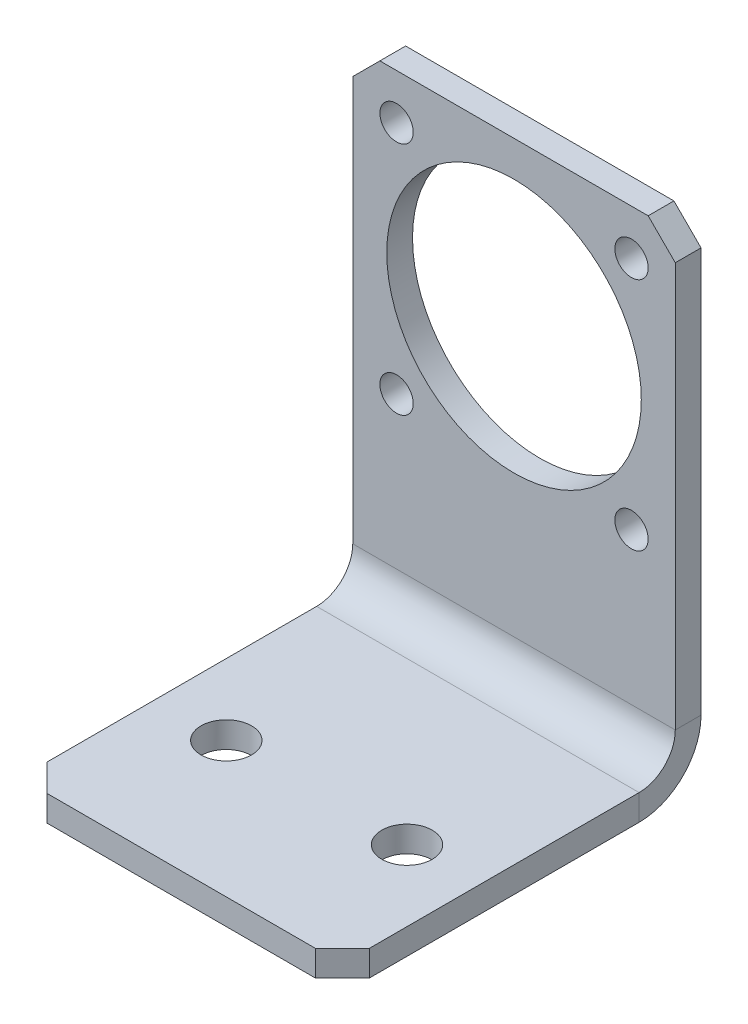
ISO-10303-21;
HEADER;
FILE_DESCRIPTION(('STEP AP214'),'2;1');
FILE_NAME('part.step','',(''),(''),'','','');
FILE_SCHEMA(('AUTOMOTIVE_DESIGN { 1 0 10303 214 1 1 1 1 }'));
ENDSEC;
DATA;
#1=APPLICATION_CONTEXT('core data for automotive mechanical design processes');
#2=APPLICATION_PROTOCOL_DEFINITION('international standard','automotive_design',2000,#1);
#3=PRODUCT_CONTEXT('',#1,'mechanical');
#4=PRODUCT('Part','Part','',(#3));
#5=PRODUCT_RELATED_PRODUCT_CATEGORY('part','',(#4));
#6=PRODUCT_DEFINITION_FORMATION('','',#4);
#7=PRODUCT_DEFINITION_CONTEXT('part definition',#1,'design');
#8=PRODUCT_DEFINITION('design','',#6,#7);
#9=PRODUCT_DEFINITION_SHAPE('','',#8);
#10=(LENGTH_UNIT() NAMED_UNIT(*) SI_UNIT(.MILLI.,.METRE.));
#11=(NAMED_UNIT(*) PLANE_ANGLE_UNIT() SI_UNIT($,.RADIAN.));
#12=(NAMED_UNIT(*) SI_UNIT($,.STERADIAN.) SOLID_ANGLE_UNIT());
#13=UNCERTAINTY_MEASURE_WITH_UNIT(LENGTH_MEASURE(1.E-05),#10,'distance_accuracy_value','');
#14=(GEOMETRIC_REPRESENTATION_CONTEXT(3) GLOBAL_UNCERTAINTY_ASSIGNED_CONTEXT((#13)) GLOBAL_UNIT_ASSIGNED_CONTEXT((#10,
#11,#12)) REPRESENTATION_CONTEXT('',''));
#15=CARTESIAN_POINT('',(0.,0.,0.));
#16=DIRECTION('',(0.,0.,1.));
#17=DIRECTION('',(1.,0.,0.));
#18=AXIS2_PLACEMENT_3D('',#15,#16,#17);
#19=CARTESIAN_POINT('',(0.,7.20842992713764,7.72999999999997));
#20=DIRECTION('',(0.,0.,-1.));
#21=DIRECTION('',(0.,1.,0.));
#22=AXIS2_PLACEMENT_3D('',#19,#20,#21);
#23=PLANE('',#22);
#24=CARTESIAN_POINT('',(13.,20.7784299271377,7.72999999999995));
#25=DIRECTION('',(0.,0.,1.));
#26=DIRECTION('',(-1.,0.,0.));
#27=AXIS2_PLACEMENT_3D('',#24,#25,#26);
#28=CIRCLE('',#27,1.845);
#29=CARTESIAN_POINT('',(11.155,20.7784299271377,7.72999999999995));
#30=VERTEX_POINT('',#29);
#31=EDGE_CURVE('E234',#30,#30,#28,.T.);
#32=ORIENTED_EDGE('',*,*,#31,.F.);
#33=EDGE_LOOP('',(#32));
#34=FACE_BOUND('',#33,.T.);
#35=CARTESIAN_POINT('',(-13.,20.7784299271377,7.72999999999995));
#36=DIRECTION('',(0.,0.,1.));
#37=DIRECTION('',(1.,0.,0.));
#38=AXIS2_PLACEMENT_3D('',#35,#36,#37);
#39=CIRCLE('',#38,1.845);
#40=CARTESIAN_POINT('',(-11.155,20.7784299271377,7.72999999999995));
#41=VERTEX_POINT('',#40);
#42=EDGE_CURVE('E230',#41,#41,#39,.T.);
#43=ORIENTED_EDGE('',*,*,#42,.F.);
#44=EDGE_LOOP('',(#43));
#45=FACE_BOUND('',#44,.T.);
#46=CARTESIAN_POINT('',(-13.,46.7784299271377,7.72999999999995));
#47=DIRECTION('',(0.,0.,1.));
#48=DIRECTION('',(-1.,0.,0.));
#49=AXIS2_PLACEMENT_3D('',#46,#47,#48);
#50=CIRCLE('',#49,1.845);
#51=CARTESIAN_POINT('',(-14.845,46.7784299271377,7.72999999999995));
#52=VERTEX_POINT('',#51);
#53=EDGE_CURVE('E226',#52,#52,#50,.T.);
#54=ORIENTED_EDGE('',*,*,#53,.F.);
#55=EDGE_LOOP('',(#54));
#56=FACE_BOUND('',#55,.T.);
#57=CARTESIAN_POINT('',(13.,46.7784299271377,7.72999999999995));
#58=DIRECTION('',(0.,0.,1.));
#59=DIRECTION('',(1.,0.,0.));
#60=AXIS2_PLACEMENT_3D('',#57,#58,#59);
#61=CIRCLE('',#60,1.845);
#62=CARTESIAN_POINT('',(14.845,46.7784299271377,7.72999999999995));
#63=VERTEX_POINT('',#62);
#64=EDGE_CURVE('E222',#63,#63,#61,.T.);
#65=ORIENTED_EDGE('',*,*,#64,.F.);
#66=EDGE_LOOP('',(#65));
#67=FACE_BOUND('',#66,.T.);
#68=CARTESIAN_POINT('',(0.,33.7784299271377,7.72999999999995));
#69=DIRECTION('',(0.,0.,1.));
#70=DIRECTION('',(1.,0.,0.));
#71=AXIS2_PLACEMENT_3D('',#68,#69,#70);
#72=CIRCLE('',#71,14.0825);
#73=CARTESIAN_POINT('',(14.0825,33.7784299271377,7.72999999999995));
#74=VERTEX_POINT('',#73);
#75=EDGE_CURVE('E218',#74,#74,#72,.T.);
#76=ORIENTED_EDGE('',*,*,#75,.F.);
#77=EDGE_LOOP('',(#76));
#78=FACE_BOUND('',#77,.T.);
#79=DIRECTION('',(0.,1.,0.));
#80=VECTOR('',#79,1.);
#81=CARTESIAN_POINT('',(17.845,-37.3615700728623,7.72999999999982));
#82=LINE('',#81,#80);
#83=CARTESIAN_POINT('',(17.845,4.00000000000001,7.72999999999996));
#84=VERTEX_POINT('',#83);
#85=CARTESIAN_POINT('',(17.845,48.7784299271376,7.73000000000012));
#86=VERTEX_POINT('',#85);
#87=EDGE_CURVE('E165',#84,#86,#82,.T.);
#88=ORIENTED_EDGE('',*,*,#87,.T.);
#89=DIRECTION('',(0.707106781186551,-0.707106781186544,0.));
#90=VECTOR('',#89,1.);
#91=CARTESIAN_POINT('',(17.845,48.7784299271376,7.73000000000012));
#92=LINE('',#91,#90);
#93=CARTESIAN_POINT('',(14.845,51.7784299271376,7.73000000000013));
#94=VERTEX_POINT('',#93);
#95=EDGE_CURVE('E255',#86,#94,#92,.F.);
#96=ORIENTED_EDGE('',*,*,#95,.T.);
#97=DIRECTION('',(-1.,0.,0.));
#98=VECTOR('',#97,1.);
#99=CARTESIAN_POINT('',(-17.845,51.7784299271376,7.73000000000013));
#100=LINE('',#99,#98);
#101=CARTESIAN_POINT('',(-14.845,51.7784299271376,7.73000000000013));
#102=VERTEX_POINT('',#101);
#103=EDGE_CURVE('E194',#94,#102,#100,.T.);
#104=ORIENTED_EDGE('',*,*,#103,.T.);
#105=DIRECTION('',(0.707106781186545,0.70710678118655,0.));
#106=VECTOR('',#105,1.);
#107=CARTESIAN_POINT('',(-14.845,51.7784299271376,7.73000000000013));
#108=LINE('',#107,#106);
#109=CARTESIAN_POINT('',(-17.845,48.7784299271376,7.73000000000012));
#110=VERTEX_POINT('',#109);
#111=EDGE_CURVE('E253',#102,#110,#108,.F.);
#112=ORIENTED_EDGE('',*,*,#111,.T.);
#113=DIRECTION('',(0.,-1.,0.));
#114=VECTOR('',#113,1.);
#115=CARTESIAN_POINT('',(-17.845,-37.3615700728623,7.72999999999982));
#116=LINE('',#115,#114);
#117=CARTESIAN_POINT('',(-17.845,4.00000000000001,7.72999999999996));
#118=VERTEX_POINT('',#117);
#119=EDGE_CURVE('E197',#110,#118,#116,.T.);
#120=ORIENTED_EDGE('',*,*,#119,.T.);
#121=DIRECTION('',(1.,0.,0.));
#122=VECTOR('',#121,1.);
#123=CARTESIAN_POINT('',(0.,4.00000000000001,7.72999999999996));
#124=LINE('',#123,#122);
#125=EDGE_CURVE('E203',#118,#84,#124,.T.);
#126=ORIENTED_EDGE('',*,*,#125,.T.);
#127=EDGE_LOOP('',(#88,#96,#104,#112,#120,#126));
#128=FACE_BOUND('',#127,.T.);
#129=ADVANCED_FACE('F42',(#34,#45,#56,#67,#78,#128),#23,.F.);
#130=CARTESIAN_POINT('',(17.845,-37.3615700728623,4.87999999999982));
#131=DIRECTION('',(1.,0.,0.));
#132=DIRECTION('',(0.,1.,0.));
#133=AXIS2_PLACEMENT_3D('',#130,#131,#132);
#134=PLANE('',#133);
#135=DIRECTION('',(0.,1.,0.));
#136=VECTOR('',#135,1.);
#137=CARTESIAN_POINT('',(17.845,-37.3615700728623,4.87999999999982));
#138=LINE('',#137,#136);
#139=CARTESIAN_POINT('',(17.845,4.00000000000002,4.87999999999996));
#140=VERTEX_POINT('',#139);
#141=CARTESIAN_POINT('',(17.845,48.7784299271376,4.88000000000012));
#142=VERTEX_POINT('',#141);
#143=EDGE_CURVE('E193',#140,#142,#138,.T.);
#144=ORIENTED_EDGE('',*,*,#143,.T.);
#145=DIRECTION('',(0.,0.,1.));
#146=VECTOR('',#145,1.);
#147=CARTESIAN_POINT('',(17.845,48.7784299271377,4.88000000000012));
#148=LINE('',#147,#146);
#149=EDGE_CURVE('E250',#142,#86,#148,.T.);
#150=ORIENTED_EDGE('',*,*,#149,.T.);
#151=ORIENTED_EDGE('',*,*,#87,.F.);
#152=DIRECTION('',(0.,0.,1.));
#153=VECTOR('',#152,1.);
#154=CARTESIAN_POINT('',(17.845,4.00000000000002,4.87999999999996));
#155=LINE('',#154,#153);
#156=EDGE_CURVE('E200',#140,#84,#155,.T.);
#157=ORIENTED_EDGE('',*,*,#156,.F.);
#158=EDGE_LOOP('',(#144,#150,#151,#157));
#159=FACE_BOUND('',#158,.T.);
#160=ADVANCED_FACE('F270',(#159),#134,.T.);
#161=CARTESIAN_POINT('',(-17.845,-37.3615700728623,4.87999999999982));
#162=DIRECTION('',(-1.,0.,0.));
#163=DIRECTION('',(0.,-1.,0.));
#164=AXIS2_PLACEMENT_3D('',#161,#162,#163);
#165=PLANE('',#164);
#166=ORIENTED_EDGE('',*,*,#119,.F.);
#167=DIRECTION('',(0.,0.,-1.));
#168=VECTOR('',#167,1.);
#169=CARTESIAN_POINT('',(-17.845,48.7784299271376,4.88000000000012));
#170=LINE('',#169,#168);
#171=CARTESIAN_POINT('',(-17.845,48.7784299271376,4.88000000000012));
#172=VERTEX_POINT('',#171);
#173=EDGE_CURVE('E12',#110,#172,#170,.T.);
#174=ORIENTED_EDGE('',*,*,#173,.T.);
#175=DIRECTION('',(0.,-1.,0.));
#176=VECTOR('',#175,1.);
#177=CARTESIAN_POINT('',(-17.845,-37.3615700728623,4.87999999999982));
#178=LINE('',#177,#176);
#179=CARTESIAN_POINT('',(-17.845,4.00000000000002,4.87999999999996));
#180=VERTEX_POINT('',#179);
#181=EDGE_CURVE('E192',#172,#180,#178,.T.);
#182=ORIENTED_EDGE('',*,*,#181,.T.);
#183=DIRECTION('',(0.,0.,-1.));
#184=VECTOR('',#183,1.);
#185=CARTESIAN_POINT('',(-17.845,4.00000000000002,4.87999999999996));
#186=LINE('',#185,#184);
#187=EDGE_CURVE('E139',#118,#180,#186,.T.);
#188=ORIENTED_EDGE('',*,*,#187,.F.);
#189=EDGE_LOOP('',(#166,#174,#182,#188));
#190=FACE_BOUND('',#189,.T.);
#191=ADVANCED_FACE('F278',(#190),#165,.T.);
#192=CARTESIAN_POINT('',(-17.845,51.7784299271376,4.88000000000013));
#193=DIRECTION('',(0.,1.,0.));
#194=DIRECTION('',(-1.,0.,0.));
#195=AXIS2_PLACEMENT_3D('',#192,#193,#194);
#196=PLANE('',#195);
#197=ORIENTED_EDGE('',*,*,#103,.F.);
#198=DIRECTION('',(0.,0.,-1.));
#199=VECTOR('',#198,1.);
#200=CARTESIAN_POINT('',(14.845,51.7784299271376,4.88000000000013));
#201=LINE('',#200,#199);
#202=CARTESIAN_POINT('',(14.845,51.7784299271376,4.88000000000013));
#203=VERTEX_POINT('',#202);
#204=EDGE_CURVE('E260',#94,#203,#201,.T.);
#205=ORIENTED_EDGE('',*,*,#204,.T.);
#206=DIRECTION('',(-1.,0.,0.));
#207=VECTOR('',#206,1.);
#208=CARTESIAN_POINT('',(-17.845,51.7784299271376,4.88000000000013));
#209=LINE('',#208,#207);
#210=CARTESIAN_POINT('',(-14.845,51.7784299271376,4.88000000000013));
#211=VERTEX_POINT('',#210);
#212=EDGE_CURVE('E190',#203,#211,#209,.T.);
#213=ORIENTED_EDGE('',*,*,#212,.T.);
#214=DIRECTION('',(0.,0.,1.));
#215=VECTOR('',#214,1.);
#216=CARTESIAN_POINT('',(-14.845,51.7784299271376,4.88000000000013));
#217=LINE('',#216,#215);
#218=EDGE_CURVE('E257',#211,#102,#217,.T.);
#219=ORIENTED_EDGE('',*,*,#218,.T.);
#220=EDGE_LOOP('',(#197,#205,#213,#219));
#221=FACE_BOUND('',#220,.T.);
#222=ADVANCED_FACE('F275',(#221),#196,.T.);
#223=CARTESIAN_POINT('',(0.,7.20842992713765,4.87999999999997));
#224=DIRECTION('',(0.,0.,-1.));
#225=DIRECTION('',(0.,1.,0.));
#226=AXIS2_PLACEMENT_3D('',#223,#224,#225);
#227=PLANE('',#226);
#228=CARTESIAN_POINT('',(13.,20.7784299271377,4.88000000000002));
#229=DIRECTION('',(0.,0.,-1.));
#230=DIRECTION('',(0.,1.,0.));
#231=AXIS2_PLACEMENT_3D('',#228,#229,#230);
#232=CIRCLE('',#231,1.845);
#233=CARTESIAN_POINT('',(13.,22.6234299271377,4.88000000000003));
#234=VERTEX_POINT('',#233);
#235=EDGE_CURVE('E231',#234,#234,#232,.T.);
#236=ORIENTED_EDGE('',*,*,#235,.F.);
#237=EDGE_LOOP('',(#236));
#238=FACE_BOUND('',#237,.T.);
#239=CARTESIAN_POINT('',(-13.,20.7784299271377,4.88000000000002));
#240=DIRECTION('',(0.,0.,-1.));
#241=DIRECTION('',(0.,1.,0.));
#242=AXIS2_PLACEMENT_3D('',#239,#240,#241);
#243=CIRCLE('',#242,1.845);
#244=CARTESIAN_POINT('',(-13.,22.6234299271377,4.88000000000003));
#245=VERTEX_POINT('',#244);
#246=EDGE_CURVE('E227',#245,#245,#243,.T.);
#247=ORIENTED_EDGE('',*,*,#246,.F.);
#248=EDGE_LOOP('',(#247));
#249=FACE_BOUND('',#248,.T.);
#250=CARTESIAN_POINT('',(-13.,46.7784299271377,4.88000000000011));
#251=DIRECTION('',(0.,0.,-1.));
#252=DIRECTION('',(0.,1.,0.));
#253=AXIS2_PLACEMENT_3D('',#250,#251,#252);
#254=CIRCLE('',#253,1.845);
#255=CARTESIAN_POINT('',(-13.,48.6234299271377,4.88000000000012));
#256=VERTEX_POINT('',#255);
#257=EDGE_CURVE('E223',#256,#256,#254,.T.);
#258=ORIENTED_EDGE('',*,*,#257,.F.);
#259=EDGE_LOOP('',(#258));
#260=FACE_BOUND('',#259,.T.);
#261=CARTESIAN_POINT('',(13.,46.7784299271377,4.88000000000011));
#262=DIRECTION('',(0.,0.,-1.));
#263=DIRECTION('',(0.,1.,0.));
#264=AXIS2_PLACEMENT_3D('',#261,#262,#263);
#265=CIRCLE('',#264,1.845);
#266=CARTESIAN_POINT('',(13.,48.6234299271376,4.88000000000012));
#267=VERTEX_POINT('',#266);
#268=EDGE_CURVE('E219',#267,#267,#265,.T.);
#269=ORIENTED_EDGE('',*,*,#268,.F.);
#270=EDGE_LOOP('',(#269));
#271=FACE_BOUND('',#270,.T.);
#272=CARTESIAN_POINT('',(0.,33.7784299271377,4.88000000000007));
#273=DIRECTION('',(0.,0.,-1.));
#274=DIRECTION('',(0.,1.,0.));
#275=AXIS2_PLACEMENT_3D('',#272,#273,#274);
#276=CIRCLE('',#275,14.0825);
#277=CARTESIAN_POINT('',(0.,47.8609299271377,4.88000000000012));
#278=VERTEX_POINT('',#277);
#279=EDGE_CURVE('E214',#278,#278,#276,.T.);
#280=ORIENTED_EDGE('',*,*,#279,.F.);
#281=EDGE_LOOP('',(#280));
#282=FACE_BOUND('',#281,.T.);
#283=ORIENTED_EDGE('',*,*,#212,.F.);
#284=DIRECTION('',(-0.707106781186551,0.707106781186544,0.));
#285=VECTOR('',#284,1.);
#286=CARTESIAN_POINT('',(29.7074999999999,36.9159299271378,4.88000000000008));
#287=LINE('',#286,#285);
#288=EDGE_CURVE('E50',#203,#142,#287,.F.);
#289=ORIENTED_EDGE('',*,*,#288,.T.);
#290=ORIENTED_EDGE('',*,*,#143,.F.);
#291=DIRECTION('',(1.,0.,0.));
#292=VECTOR('',#291,1.);
#293=CARTESIAN_POINT('',(0.,4.00000000000002,4.87999999999996));
#294=LINE('',#293,#292);
#295=EDGE_CURVE('E198',#180,#140,#294,.T.);
#296=ORIENTED_EDGE('',*,*,#295,.F.);
#297=ORIENTED_EDGE('',*,*,#181,.F.);
#298=DIRECTION('',(-0.707106781186545,-0.70710678118655,0.));
#299=VECTOR('',#298,1.);
#300=CARTESIAN_POINT('',(-29.7075,36.9159299271375,4.88000000000008));
#301=LINE('',#300,#299);
#302=EDGE_CURVE('E62',#172,#211,#301,.F.);
#303=ORIENTED_EDGE('',*,*,#302,.T.);
#304=EDGE_LOOP('',(#283,#289,#290,#296,#297,#303));
#305=FACE_BOUND('',#304,.T.);
#306=ADVANCED_FACE('F264',(#238,#249,#260,#271,#282,#305),#227,.T.);
#307=CARTESIAN_POINT('',(-17.845,-2.85,44.57));
#308=DIRECTION('',(0.,0.,1.));
#309=DIRECTION('',(1.,0.,0.));
#310=AXIS2_PLACEMENT_3D('',#307,#308,#309);
#311=PLANE('',#310);
#312=DIRECTION('',(1.,0.,0.));
#313=VECTOR('',#312,1.);
#314=CARTESIAN_POINT('',(-17.845,0.,44.57));
#315=LINE('',#314,#313);
#316=CARTESIAN_POINT('',(-14.845,0.,44.57));
#317=VERTEX_POINT('',#316);
#318=CARTESIAN_POINT('',(14.845,0.,44.57));
#319=VERTEX_POINT('',#318);
#320=EDGE_CURVE('E174',#317,#319,#315,.T.);
#321=ORIENTED_EDGE('',*,*,#320,.F.);
#322=DIRECTION('',(0.,-1.,0.));
#323=VECTOR('',#322,1.);
#324=CARTESIAN_POINT('',(-14.845,-2.85,44.57));
#325=LINE('',#324,#323);
#326=CARTESIAN_POINT('',(-14.845,-2.85,44.57));
#327=VERTEX_POINT('',#326);
#328=EDGE_CURVE('E243',#317,#327,#325,.T.);
#329=ORIENTED_EDGE('',*,*,#328,.T.);
#330=DIRECTION('',(1.,0.,0.));
#331=VECTOR('',#330,1.);
#332=CARTESIAN_POINT('',(-17.845,-2.85,44.57));
#333=LINE('',#332,#331);
#334=CARTESIAN_POINT('',(14.845,-2.85,44.57));
#335=VERTEX_POINT('',#334);
#336=EDGE_CURVE('E154',#327,#335,#333,.T.);
#337=ORIENTED_EDGE('',*,*,#336,.T.);
#338=DIRECTION('',(0.,1.,0.));
#339=VECTOR('',#338,1.);
#340=CARTESIAN_POINT('',(14.845,-2.85,44.57));
#341=LINE('',#340,#339);
#342=EDGE_CURVE('E240',#335,#319,#341,.T.);
#343=ORIENTED_EDGE('',*,*,#342,.T.);
#344=EDGE_LOOP('',(#321,#329,#337,#343));
#345=FACE_BOUND('',#344,.T.);
#346=ADVANCED_FACE('F331',(#345),#311,.T.);
#347=CARTESIAN_POINT('',(0.,-2.85,0.));
#348=DIRECTION('',(0.,-1.,0.));
#349=DIRECTION('',(0.,0.,-1.));
#350=AXIS2_PLACEMENT_3D('',#347,#348,#349);
#351=PLANE('',#350);
#352=CARTESIAN_POINT('',(10.,-2.85,29.57));
#353=DIRECTION('',(0.,-1.,0.));
#354=DIRECTION('',(0.,0.,-1.));
#355=AXIS2_PLACEMENT_3D('',#352,#353,#354);
#356=CIRCLE('',#355,2.795);
#357=CARTESIAN_POINT('',(10.,-2.85,26.775));
#358=VERTEX_POINT('',#357);
#359=EDGE_CURVE('E303',#358,#358,#356,.T.);
#360=ORIENTED_EDGE('',*,*,#359,.F.);
#361=EDGE_LOOP('',(#360));
#362=FACE_BOUND('',#361,.T.);
#363=CARTESIAN_POINT('',(-10.,-2.85,29.57));
#364=DIRECTION('',(0.,-1.,0.));
#365=DIRECTION('',(0.,0.,-1.));
#366=AXIS2_PLACEMENT_3D('',#363,#364,#365);
#367=CIRCLE('',#366,2.795);
#368=CARTESIAN_POINT('',(-10.,-2.85,26.775));
#369=VERTEX_POINT('',#368);
#370=EDGE_CURVE('E297',#369,#369,#367,.T.);
#371=ORIENTED_EDGE('',*,*,#370,.F.);
#372=EDGE_LOOP('',(#371));
#373=FACE_BOUND('',#372,.T.);
#374=ORIENTED_EDGE('',*,*,#336,.F.);
#375=DIRECTION('',(0.70710678118655,0.,0.707106781186545));
#376=VECTOR('',#375,1.);
#377=CARTESIAN_POINT('',(-29.7074999999999,-2.85,29.7075000000001));
#378=LINE('',#377,#376);
#379=CARTESIAN_POINT('',(-17.845,-2.85,41.57));
#380=VERTEX_POINT('',#379);
#381=EDGE_CURVE('E161',#327,#380,#378,.F.);
#382=ORIENTED_EDGE('',*,*,#381,.T.);
#383=DIRECTION('',(0.,0.,1.));
#384=VECTOR('',#383,1.);
#385=CARTESIAN_POINT('',(-17.845,-2.85,44.57));
#386=LINE('',#385,#384);
#387=CARTESIAN_POINT('',(-17.845,-2.85,11.73));
#388=VERTEX_POINT('',#387);
#389=EDGE_CURVE('E157',#388,#380,#386,.T.);
#390=ORIENTED_EDGE('',*,*,#389,.F.);
#391=DIRECTION('',(1.,0.,0.));
#392=VECTOR('',#391,1.);
#393=CARTESIAN_POINT('',(0.,-2.85,11.73));
#394=LINE('',#393,#392);
#395=CARTESIAN_POINT('',(17.845,-2.85,11.73));
#396=VERTEX_POINT('',#395);
#397=EDGE_CURVE('E147',#388,#396,#394,.T.);
#398=ORIENTED_EDGE('',*,*,#397,.T.);
#399=DIRECTION('',(0.,0.,-1.));
#400=VECTOR('',#399,1.);
#401=CARTESIAN_POINT('',(17.845,-2.85,44.57));
#402=LINE('',#401,#400);
#403=CARTESIAN_POINT('',(17.845,-2.85,41.57));
#404=VERTEX_POINT('',#403);
#405=EDGE_CURVE('E153',#404,#396,#402,.T.);
#406=ORIENTED_EDGE('',*,*,#405,.F.);
#407=DIRECTION('',(0.707106781186545,0.,-0.70710678118655));
#408=VECTOR('',#407,1.);
#409=CARTESIAN_POINT('',(29.7075,-2.85,29.7074999999998));
#410=LINE('',#409,#408);
#411=EDGE_CURVE('E245',#404,#335,#410,.F.);
#412=ORIENTED_EDGE('',*,*,#411,.T.);
#413=EDGE_LOOP('',(#374,#382,#390,#398,#406,#412));
#414=FACE_BOUND('',#413,.T.);
#415=ADVANCED_FACE('F159',(#362,#373,#414),#351,.T.);
#416=CARTESIAN_POINT('',(17.845,-2.85,44.57));
#417=DIRECTION('',(1.,0.,0.));
#418=DIRECTION('',(0.,0.,-1.));
#419=AXIS2_PLACEMENT_3D('',#416,#417,#418);
#420=PLANE('',#419);
#421=DIRECTION('',(0.,0.,-1.));
#422=VECTOR('',#421,1.);
#423=CARTESIAN_POINT('',(17.845,0.,44.57));
#424=LINE('',#423,#422);
#425=CARTESIAN_POINT('',(17.845,0.,41.57));
#426=VERTEX_POINT('',#425);
#427=CARTESIAN_POINT('',(17.845,0.,11.73));
#428=VERTEX_POINT('',#427);
#429=EDGE_CURVE('E172',#426,#428,#424,.T.);
#430=ORIENTED_EDGE('',*,*,#429,.F.);
#431=DIRECTION('',(0.,-1.,0.));
#432=VECTOR('',#431,1.);
#433=CARTESIAN_POINT('',(17.845,-2.85,41.57));
#434=LINE('',#433,#432);
#435=EDGE_CURVE('E248',#426,#404,#434,.T.);
#436=ORIENTED_EDGE('',*,*,#435,.T.);
#437=ORIENTED_EDGE('',*,*,#405,.T.);
#438=DIRECTION('',(0.,1.,0.));
#439=VECTOR('',#438,1.);
#440=CARTESIAN_POINT('',(17.845,-2.85,11.73));
#441=LINE('',#440,#439);
#442=EDGE_CURVE('E181',#396,#428,#441,.T.);
#443=ORIENTED_EDGE('',*,*,#442,.T.);
#444=EDGE_LOOP('',(#430,#436,#437,#443));
#445=FACE_BOUND('',#444,.T.);
#446=ADVANCED_FACE('F315',(#445),#420,.T.);
#447=CARTESIAN_POINT('',(0.,0.,0.));
#448=DIRECTION('',(0.,-1.,0.));
#449=DIRECTION('',(0.,0.,-1.));
#450=AXIS2_PLACEMENT_3D('',#447,#448,#449);
#451=PLANE('',#450);
#452=CARTESIAN_POINT('',(10.,0.,29.57));
#453=DIRECTION('',(0.,1.,0.));
#454=DIRECTION('',(0.,0.,-1.));
#455=AXIS2_PLACEMENT_3D('',#452,#453,#454);
#456=CIRCLE('',#455,2.795);
#457=CARTESIAN_POINT('',(10.,0.,26.775));
#458=VERTEX_POINT('',#457);
#459=EDGE_CURVE('E306',#458,#458,#456,.T.);
#460=ORIENTED_EDGE('',*,*,#459,.F.);
#461=EDGE_LOOP('',(#460));
#462=FACE_BOUND('',#461,.T.);
#463=CARTESIAN_POINT('',(-10.,0.,29.57));
#464=DIRECTION('',(0.,1.,0.));
#465=DIRECTION('',(0.,0.,1.));
#466=AXIS2_PLACEMENT_3D('',#463,#464,#465);
#467=CIRCLE('',#466,2.795);
#468=CARTESIAN_POINT('',(-10.,0.,32.365));
#469=VERTEX_POINT('',#468);
#470=EDGE_CURVE('E300',#469,#469,#467,.T.);
#471=ORIENTED_EDGE('',*,*,#470,.F.);
#472=EDGE_LOOP('',(#471));
#473=FACE_BOUND('',#472,.T.);
#474=DIRECTION('',(0.,0.,1.));
#475=VECTOR('',#474,1.);
#476=CARTESIAN_POINT('',(-17.845,0.,44.57));
#477=LINE('',#476,#475);
#478=CARTESIAN_POINT('',(-17.845,0.,11.73));
#479=VERTEX_POINT('',#478);
#480=CARTESIAN_POINT('',(-17.845,0.,41.57));
#481=VERTEX_POINT('',#480);
#482=EDGE_CURVE('E170',#479,#481,#477,.T.);
#483=ORIENTED_EDGE('',*,*,#482,.T.);
#484=DIRECTION('',(-0.70710678118655,0.,-0.707106781186545));
#485=VECTOR('',#484,1.);
#486=CARTESIAN_POINT('',(-17.845,0.,41.57));
#487=LINE('',#486,#485);
#488=EDGE_CURVE('E238',#481,#317,#487,.F.);
#489=ORIENTED_EDGE('',*,*,#488,.T.);
#490=ORIENTED_EDGE('',*,*,#320,.T.);
#491=DIRECTION('',(-0.707106781186545,0.,0.70710678118655));
#492=VECTOR('',#491,1.);
#493=CARTESIAN_POINT('',(14.845,0.,44.57));
#494=LINE('',#493,#492);
#495=EDGE_CURVE('E236',#319,#426,#494,.F.);
#496=ORIENTED_EDGE('',*,*,#495,.T.);
#497=ORIENTED_EDGE('',*,*,#429,.T.);
#498=DIRECTION('',(1.,0.,0.));
#499=VECTOR('',#498,1.);
#500=CARTESIAN_POINT('',(0.,0.,11.73));
#501=LINE('',#500,#499);
#502=EDGE_CURVE('E187',#479,#428,#501,.T.);
#503=ORIENTED_EDGE('',*,*,#502,.F.);
#504=EDGE_LOOP('',(#483,#489,#490,#496,#497,#503));
#505=FACE_BOUND('',#504,.T.);
#506=ADVANCED_FACE('F312',(#462,#473,#505),#451,.F.);
#507=CARTESIAN_POINT('',(-17.845,-2.85,44.57));
#508=DIRECTION('',(-1.,0.,0.));
#509=DIRECTION('',(0.,0.,1.));
#510=AXIS2_PLACEMENT_3D('',#507,#508,#509);
#511=PLANE('',#510);
#512=ORIENTED_EDGE('',*,*,#389,.T.);
#513=DIRECTION('',(0.,1.,0.));
#514=VECTOR('',#513,1.);
#515=CARTESIAN_POINT('',(-17.845,-2.85,41.57));
#516=LINE('',#515,#514);
#517=EDGE_CURVE('E207',#380,#481,#516,.T.);
#518=ORIENTED_EDGE('',*,*,#517,.T.);
#519=ORIENTED_EDGE('',*,*,#482,.F.);
#520=DIRECTION('',(0.,-1.,0.));
#521=VECTOR('',#520,1.);
#522=CARTESIAN_POINT('',(-17.845,-2.85,11.73));
#523=LINE('',#522,#521);
#524=EDGE_CURVE('E136',#479,#388,#523,.T.);
#525=ORIENTED_EDGE('',*,*,#524,.T.);
#526=EDGE_LOOP('',(#512,#518,#519,#525));
#527=FACE_BOUND('',#526,.T.);
#528=ADVANCED_FACE('F168',(#527),#511,.T.);
#529=CARTESIAN_POINT('',(-17.845,4.,11.73));
#530=DIRECTION('',(-1.,0.,0.));
#531=DIRECTION('',(0.,0.,1.));
#532=AXIS2_PLACEMENT_3D('',#529,#530,#531);
#533=PLANE('',#532);
#534=ORIENTED_EDGE('',*,*,#524,.F.);
#535=CARTESIAN_POINT('',(-17.845,4.,11.73));
#536=DIRECTION('',(1.,0.,0.));
#537=DIRECTION('',(0.,0.,-1.));
#538=AXIS2_PLACEMENT_3D('',#535,#536,#537);
#539=CIRCLE('',#538,4.);
#540=EDGE_CURVE('E217',#479,#118,#539,.T.);
#541=ORIENTED_EDGE('',*,*,#540,.T.);
#542=ORIENTED_EDGE('',*,*,#187,.T.);
#543=CARTESIAN_POINT('',(-17.845,4.,11.73));
#544=DIRECTION('',(1.,0.,0.));
#545=DIRECTION('',(0.,0.,1.));
#546=AXIS2_PLACEMENT_3D('',#543,#544,#545);
#547=CIRCLE('',#546,6.85);
#548=EDGE_CURVE('E131',#388,#180,#547,.T.);
#549=ORIENTED_EDGE('',*,*,#548,.F.);
#550=EDGE_LOOP('',(#534,#541,#542,#549));
#551=FACE_BOUND('',#550,.T.);
#552=ADVANCED_FACE('F133',(#551),#533,.T.);
#553=CARTESIAN_POINT('',(17.845,4.,11.73));
#554=DIRECTION('',(1.,0.,0.));
#555=DIRECTION('',(0.,0.,-1.));
#556=AXIS2_PLACEMENT_3D('',#553,#554,#555);
#557=PLANE('',#556);
#558=ORIENTED_EDGE('',*,*,#156,.T.);
#559=CARTESIAN_POINT('',(17.845,4.,11.73));
#560=DIRECTION('',(1.,0.,0.));
#561=DIRECTION('',(0.,0.,-1.));
#562=AXIS2_PLACEMENT_3D('',#559,#560,#561);
#563=CIRCLE('',#562,4.);
#564=EDGE_CURVE('E143',#84,#428,#563,.F.);
#565=ORIENTED_EDGE('',*,*,#564,.T.);
#566=ORIENTED_EDGE('',*,*,#442,.F.);
#567=CARTESIAN_POINT('',(17.845,4.,11.73));
#568=DIRECTION('',(-1.,0.,0.));
#569=DIRECTION('',(0.,0.,-1.));
#570=AXIS2_PLACEMENT_3D('',#567,#568,#569);
#571=CIRCLE('',#570,6.85);
#572=EDGE_CURVE('E142',#140,#396,#571,.T.);
#573=ORIENTED_EDGE('',*,*,#572,.F.);
#574=EDGE_LOOP('',(#558,#565,#566,#573));
#575=FACE_BOUND('',#574,.T.);
#576=ADVANCED_FACE('F323',(#575),#557,.T.);
#577=CARTESIAN_POINT('',(-36.803746500957,4.,11.73));
#578=DIRECTION('',(1.,0.,0.));
#579=DIRECTION('',(0.,0.,-1.));
#580=AXIS2_PLACEMENT_3D('',#577,#578,#579);
#581=CYLINDRICAL_SURFACE('',#580,6.85);
#582=ORIENTED_EDGE('',*,*,#572,.T.);
#583=ORIENTED_EDGE('',*,*,#397,.F.);
#584=ORIENTED_EDGE('',*,*,#548,.T.);
#585=ORIENTED_EDGE('',*,*,#295,.T.);
#586=EDGE_LOOP('',(#582,#583,#584,#585));
#587=FACE_BOUND('',#586,.T.);
#588=ADVANCED_FACE('F149',(#587),#581,.T.);
#589=CARTESIAN_POINT('',(-36.803746500957,4.,11.73));
#590=DIRECTION('',(1.,0.,0.));
#591=DIRECTION('',(0.,0.,-1.));
#592=AXIS2_PLACEMENT_3D('',#589,#590,#591);
#593=CYLINDRICAL_SURFACE('',#592,4.);
#594=ORIENTED_EDGE('',*,*,#564,.F.);
#595=ORIENTED_EDGE('',*,*,#125,.F.);
#596=ORIENTED_EDGE('',*,*,#540,.F.);
#597=ORIENTED_EDGE('',*,*,#502,.T.);
#598=EDGE_LOOP('',(#594,#595,#596,#597));
#599=FACE_BOUND('',#598,.T.);
#600=ADVANCED_FACE('F282',(#599),#593,.F.);
#601=CARTESIAN_POINT('',(0.,33.7784299271377,-2.27000000000005));
#602=DIRECTION('',(0.,0.,1.));
#603=DIRECTION('',(1.,0.,0.));
#604=AXIS2_PLACEMENT_3D('',#601,#602,#603);
#605=CYLINDRICAL_SURFACE('',#604,14.0825);
#606=ORIENTED_EDGE('',*,*,#279,.T.);
#607=EDGE_LOOP('',(#606));
#608=FACE_BOUND('',#607,.T.);
#609=ORIENTED_EDGE('',*,*,#75,.T.);
#610=EDGE_LOOP('',(#609));
#611=FACE_BOUND('',#610,.T.);
#612=ADVANCED_FACE('F382',(#608,#611),#605,.F.);
#613=CARTESIAN_POINT('',(13.,46.7784299271377,-2.27000000000005));
#614=DIRECTION('',(0.,0.,1.));
#615=DIRECTION('',(1.,0.,0.));
#616=AXIS2_PLACEMENT_3D('',#613,#614,#615);
#617=CYLINDRICAL_SURFACE('',#616,1.845);
#618=ORIENTED_EDGE('',*,*,#268,.T.);
#619=EDGE_LOOP('',(#618));
#620=FACE_BOUND('',#619,.T.);
#621=ORIENTED_EDGE('',*,*,#64,.T.);
#622=EDGE_LOOP('',(#621));
#623=FACE_BOUND('',#622,.T.);
#624=ADVANCED_FACE('F387',(#620,#623),#617,.F.);
#625=CARTESIAN_POINT('',(-13.,46.7784299271377,-2.27000000000005));
#626=DIRECTION('',(0.,0.,1.));
#627=DIRECTION('',(1.,0.,0.));
#628=AXIS2_PLACEMENT_3D('',#625,#626,#627);
#629=CYLINDRICAL_SURFACE('',#628,1.845);
#630=ORIENTED_EDGE('',*,*,#257,.T.);
#631=EDGE_LOOP('',(#630));
#632=FACE_BOUND('',#631,.T.);
#633=ORIENTED_EDGE('',*,*,#53,.T.);
#634=EDGE_LOOP('',(#633));
#635=FACE_BOUND('',#634,.T.);
#636=ADVANCED_FACE('F391',(#632,#635),#629,.F.);
#637=CARTESIAN_POINT('',(-13.,20.7784299271377,-2.27000000000005));
#638=DIRECTION('',(0.,0.,1.));
#639=DIRECTION('',(1.,0.,0.));
#640=AXIS2_PLACEMENT_3D('',#637,#638,#639);
#641=CYLINDRICAL_SURFACE('',#640,1.845);
#642=ORIENTED_EDGE('',*,*,#246,.T.);
#643=EDGE_LOOP('',(#642));
#644=FACE_BOUND('',#643,.T.);
#645=ORIENTED_EDGE('',*,*,#42,.T.);
#646=EDGE_LOOP('',(#645));
#647=FACE_BOUND('',#646,.T.);
#648=ADVANCED_FACE('F343',(#644,#647),#641,.F.);
#649=CARTESIAN_POINT('',(13.,20.7784299271377,-2.27000000000005));
#650=DIRECTION('',(0.,0.,1.));
#651=DIRECTION('',(1.,0.,0.));
#652=AXIS2_PLACEMENT_3D('',#649,#650,#651);
#653=CYLINDRICAL_SURFACE('',#652,1.845);
#654=ORIENTED_EDGE('',*,*,#235,.T.);
#655=EDGE_LOOP('',(#654));
#656=FACE_BOUND('',#655,.T.);
#657=ORIENTED_EDGE('',*,*,#31,.T.);
#658=EDGE_LOOP('',(#657));
#659=FACE_BOUND('',#658,.T.);
#660=ADVANCED_FACE('F336',(#656,#659),#653,.F.);
#661=CARTESIAN_POINT('',(-17.845,-2.85,41.57));
#662=DIRECTION('',(0.707106781186545,0.,-0.70710678118655));
#663=DIRECTION('',(0.,1.,0.));
#664=AXIS2_PLACEMENT_3D('',#661,#662,#663);
#665=PLANE('',#664);
#666=ORIENTED_EDGE('',*,*,#381,.F.);
#667=ORIENTED_EDGE('',*,*,#328,.F.);
#668=ORIENTED_EDGE('',*,*,#488,.F.);
#669=ORIENTED_EDGE('',*,*,#517,.F.);
#670=EDGE_LOOP('',(#666,#667,#668,#669));
#671=FACE_BOUND('',#670,.T.);
#672=ADVANCED_FACE('F334',(#671),#665,.F.);
#673=CARTESIAN_POINT('',(14.845,-2.85,44.57));
#674=DIRECTION('',(-0.70710678118655,0.,-0.707106781186545));
#675=DIRECTION('',(0.,1.,0.));
#676=AXIS2_PLACEMENT_3D('',#673,#674,#675);
#677=PLANE('',#676);
#678=ORIENTED_EDGE('',*,*,#411,.F.);
#679=ORIENTED_EDGE('',*,*,#435,.F.);
#680=ORIENTED_EDGE('',*,*,#495,.F.);
#681=ORIENTED_EDGE('',*,*,#342,.F.);
#682=EDGE_LOOP('',(#678,#679,#680,#681));
#683=FACE_BOUND('',#682,.T.);
#684=ADVANCED_FACE('F329',(#683),#677,.F.);
#685=CARTESIAN_POINT('',(17.845,48.7784299271376,4.88000000000012));
#686=DIRECTION('',(-0.707106781186544,-0.707106781186551,0.));
#687=DIRECTION('',(0.,0.,1.));
#688=AXIS2_PLACEMENT_3D('',#685,#686,#687);
#689=PLANE('',#688);
#690=ORIENTED_EDGE('',*,*,#288,.F.);
#691=ORIENTED_EDGE('',*,*,#204,.F.);
#692=ORIENTED_EDGE('',*,*,#95,.F.);
#693=ORIENTED_EDGE('',*,*,#149,.F.);
#694=EDGE_LOOP('',(#690,#691,#692,#693));
#695=FACE_BOUND('',#694,.T.);
#696=ADVANCED_FACE('F271',(#695),#689,.F.);
#697=CARTESIAN_POINT('',(-14.845,51.7784299271376,4.88000000000013));
#698=DIRECTION('',(0.70710678118655,-0.707106781186545,0.));
#699=DIRECTION('',(0.,0.,1.));
#700=AXIS2_PLACEMENT_3D('',#697,#698,#699);
#701=PLANE('',#700);
#702=ORIENTED_EDGE('',*,*,#302,.F.);
#703=ORIENTED_EDGE('',*,*,#173,.F.);
#704=ORIENTED_EDGE('',*,*,#111,.F.);
#705=ORIENTED_EDGE('',*,*,#218,.F.);
#706=EDGE_LOOP('',(#702,#703,#704,#705));
#707=FACE_BOUND('',#706,.T.);
#708=ADVANCED_FACE('F44',(#707),#701,.F.);
#709=CARTESIAN_POINT('',(-10.,-10.,29.57));
#710=DIRECTION('',(0.,1.,0.));
#711=DIRECTION('',(0.,0.,1.));
#712=AXIS2_PLACEMENT_3D('',#709,#710,#711);
#713=CYLINDRICAL_SURFACE('',#712,2.795);
#714=ORIENTED_EDGE('',*,*,#370,.T.);
#715=EDGE_LOOP('',(#714));
#716=FACE_BOUND('',#715,.T.);
#717=ORIENTED_EDGE('',*,*,#470,.T.);
#718=EDGE_LOOP('',(#717));
#719=FACE_BOUND('',#718,.T.);
#720=ADVANCED_FACE('F399',(#716,#719),#713,.F.);
#721=CARTESIAN_POINT('',(10.,-10.,29.57));
#722=DIRECTION('',(0.,1.,0.));
#723=DIRECTION('',(0.,0.,1.));
#724=AXIS2_PLACEMENT_3D('',#721,#722,#723);
#725=CYLINDRICAL_SURFACE('',#724,2.795);
#726=ORIENTED_EDGE('',*,*,#359,.T.);
#727=EDGE_LOOP('',(#726));
#728=FACE_BOUND('',#727,.T.);
#729=ORIENTED_EDGE('',*,*,#459,.T.);
#730=EDGE_LOOP('',(#729));
#731=FACE_BOUND('',#730,.T.);
#732=ADVANCED_FACE('F310',(#728,#731),#725,.F.);
#733=CLOSED_SHELL('',(#129,#160,#191,#222,#306,#346,#415,#446,#506,#528,#552,#576,#588,#600,
#612,#624,#636,#648,#660,#672,#684,#696,#708,#720,#732));
#734=MANIFOLD_SOLID_BREP('B2',#733);
#735=ADVANCED_BREP_SHAPE_REPRESENTATION('',(#18,#734),#14);
#736=SHAPE_DEFINITION_REPRESENTATION(#9,#735);
ENDSEC;
END-ISO-10303-21;
